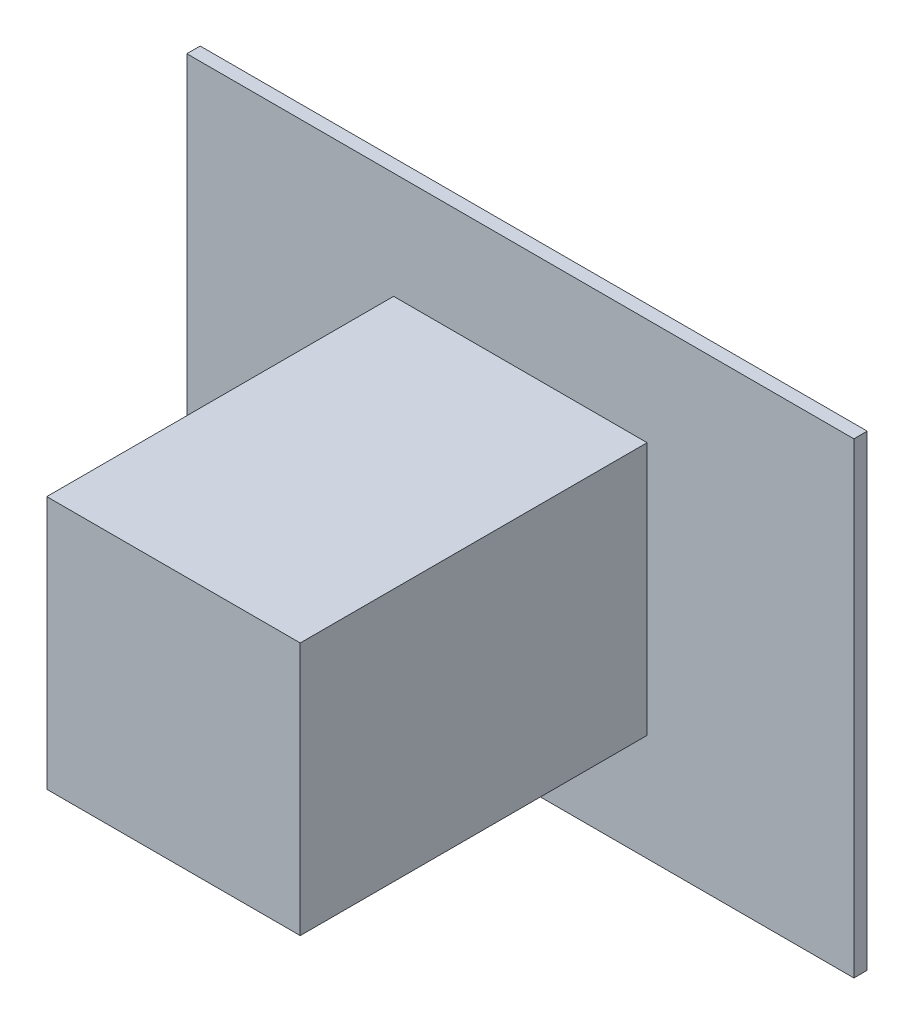
ISO-10303-21;
HEADER;
FILE_DESCRIPTION(('STEP AP214'),'2;1');
FILE_NAME('part.step','',(''),(''),'','','');
FILE_SCHEMA(('AUTOMOTIVE_DESIGN { 1 0 10303 214 1 1 1 1 }'));
ENDSEC;
DATA;
#1=APPLICATION_CONTEXT('core data for automotive mechanical design processes');
#2=APPLICATION_PROTOCOL_DEFINITION('international standard','automotive_design',2000,#1);
#3=PRODUCT_CONTEXT('',#1,'mechanical');
#4=PRODUCT('Part','Part','',(#3));
#5=PRODUCT_RELATED_PRODUCT_CATEGORY('part','',(#4));
#6=PRODUCT_DEFINITION_FORMATION('','',#4);
#7=PRODUCT_DEFINITION_CONTEXT('part definition',#1,'design');
#8=PRODUCT_DEFINITION('design','',#6,#7);
#9=PRODUCT_DEFINITION_SHAPE('','',#8);
#10=(LENGTH_UNIT() NAMED_UNIT(*) SI_UNIT(.MILLI.,.METRE.));
#11=(NAMED_UNIT(*) PLANE_ANGLE_UNIT() SI_UNIT($,.RADIAN.));
#12=(NAMED_UNIT(*) SI_UNIT($,.STERADIAN.) SOLID_ANGLE_UNIT());
#13=UNCERTAINTY_MEASURE_WITH_UNIT(LENGTH_MEASURE(1.E-05),#10,'distance_accuracy_value','');
#14=(GEOMETRIC_REPRESENTATION_CONTEXT(3) GLOBAL_UNCERTAINTY_ASSIGNED_CONTEXT((#13)) GLOBAL_UNIT_ASSIGNED_CONTEXT((#10,
#11,#12)) REPRESENTATION_CONTEXT('',''));
#15=CARTESIAN_POINT('',(0.,0.,0.));
#16=DIRECTION('',(0.,0.,1.));
#17=DIRECTION('',(1.,0.,0.));
#18=AXIS2_PLACEMENT_3D('',#15,#16,#17);
#19=CARTESIAN_POINT('',(-0.949999999999993,-0.950000000000003,3.));
#20=DIRECTION('',(1.,0.,0.));
#21=DIRECTION('',(0.,0.,-0.999999999999999));
#22=AXIS2_PLACEMENT_3D('',#19,#20,#21);
#23=PLANE('',#22);
#24=DIRECTION('',(0.,0.,-0.999999999999999));
#25=VECTOR('',#24,1.);
#26=CARTESIAN_POINT('',(-0.949999999999993,-0.950000000000003,3.));
#27=LINE('',#26,#25);
#28=CARTESIAN_POINT('',(-0.950000000000006,-0.950000000000003,0.300000000000002));
#29=VERTEX_POINT('',#28);
#30=CARTESIAN_POINT('',(-0.950000000000006,-0.950000000000003,0.));
#31=VERTEX_POINT('',#30);
#32=EDGE_CURVE('E249',#29,#31,#27,.T.);
#33=ORIENTED_EDGE('',*,*,#32,.F.);
#34=DIRECTION('',(0.,1.,0.));
#35=VECTOR('',#34,1.);
#36=CARTESIAN_POINT('',(-0.950000000000006,-0.950000000000003,0.300000000000002));
#37=LINE('',#36,#35);
#38=CARTESIAN_POINT('',(-0.949999999999993,0.949999999999996,0.300000000000002));
#39=VERTEX_POINT('',#38);
#40=EDGE_CURVE('E196',#29,#39,#37,.T.);
#41=ORIENTED_EDGE('',*,*,#40,.T.);
#42=DIRECTION('',(0.,0.,-0.999999999999999));
#43=VECTOR('',#42,1.);
#44=CARTESIAN_POINT('',(-0.95,0.949999999999996,3.));
#45=LINE('',#44,#43);
#46=CARTESIAN_POINT('',(-0.949999999999993,0.949999999999996,0.));
#47=VERTEX_POINT('',#46);
#48=EDGE_CURVE('E223',#39,#47,#45,.T.);
#49=ORIENTED_EDGE('',*,*,#48,.T.);
#50=DIRECTION('',(0.,-1.,0.));
#51=VECTOR('',#50,1.);
#52=CARTESIAN_POINT('',(-0.950000000000006,-0.950000000000003,0.));
#53=LINE('',#52,#51);
#54=EDGE_CURVE('E208',#47,#31,#53,.T.);
#55=ORIENTED_EDGE('',*,*,#54,.T.);
#56=EDGE_LOOP('',(#33,#41,#49,#55));
#57=FACE_BOUND('',#56,.T.);
#58=ADVANCED_FACE('F52',(#57),#23,.F.);
#59=CARTESIAN_POINT('',(0.95,-0.949999999999993,3.));
#60=DIRECTION('',(0.,1.,0.));
#61=DIRECTION('',(-1.,0.,0.));
#62=AXIS2_PLACEMENT_3D('',#59,#60,#61);
#63=PLANE('',#62);
#64=DIRECTION('',(0.,0.,-0.999999999999999));
#65=VECTOR('',#64,1.);
#66=CARTESIAN_POINT('',(0.95,-0.949999999999993,3.));
#67=LINE('',#66,#65);
#68=CARTESIAN_POINT('',(0.95,-0.949999999999993,0.300000000000002));
#69=VERTEX_POINT('',#68);
#70=CARTESIAN_POINT('',(0.95,-0.949999999999993,0.));
#71=VERTEX_POINT('',#70);
#72=EDGE_CURVE('E245',#69,#71,#67,.T.);
#73=ORIENTED_EDGE('',*,*,#72,.F.);
#74=DIRECTION('',(-1.,0.,0.));
#75=VECTOR('',#74,1.);
#76=CARTESIAN_POINT('',(0.95,-0.949999999999993,0.300000000000002));
#77=LINE('',#76,#75);
#78=EDGE_CURVE('E192',#69,#29,#77,.T.);
#79=ORIENTED_EDGE('',*,*,#78,.T.);
#80=ORIENTED_EDGE('',*,*,#32,.T.);
#81=DIRECTION('',(1.,0.,0.));
#82=VECTOR('',#81,1.);
#83=CARTESIAN_POINT('',(0.95,-0.949999999999993,0.));
#84=LINE('',#83,#82);
#85=EDGE_CURVE('E227',#31,#71,#84,.T.);
#86=ORIENTED_EDGE('',*,*,#85,.T.);
#87=EDGE_LOOP('',(#73,#79,#80,#86));
#88=FACE_BOUND('',#87,.T.);
#89=ADVANCED_FACE('F272',(#88),#63,.F.);
#90=CARTESIAN_POINT('',(0.95,-0.949999999999993,3.));
#91=DIRECTION('',(-1.,0.,0.));
#92=DIRECTION('',(0.,0.,0.999999999999999));
#93=AXIS2_PLACEMENT_3D('',#90,#91,#92);
#94=PLANE('',#93);
#95=DIRECTION('',(0.,0.,-0.999999999999999));
#96=VECTOR('',#95,1.);
#97=CARTESIAN_POINT('',(0.949999999999993,0.950000000000006,3.));
#98=LINE('',#97,#96);
#99=CARTESIAN_POINT('',(0.95,0.950000000000006,0.300000000000002));
#100=VERTEX_POINT('',#99);
#101=CARTESIAN_POINT('',(0.95,0.950000000000006,0.));
#102=VERTEX_POINT('',#101);
#103=EDGE_CURVE('E241',#100,#102,#98,.T.);
#104=ORIENTED_EDGE('',*,*,#103,.F.);
#105=DIRECTION('',(0.,-1.,0.));
#106=VECTOR('',#105,1.);
#107=CARTESIAN_POINT('',(0.95,-0.949999999999993,0.300000000000002));
#108=LINE('',#107,#106);
#109=EDGE_CURVE('E188',#100,#69,#108,.T.);
#110=ORIENTED_EDGE('',*,*,#109,.T.);
#111=ORIENTED_EDGE('',*,*,#72,.T.);
#112=DIRECTION('',(0.,1.,0.));
#113=VECTOR('',#112,1.);
#114=CARTESIAN_POINT('',(0.95,-0.949999999999993,0.));
#115=LINE('',#114,#113);
#116=EDGE_CURVE('E231',#71,#102,#115,.T.);
#117=ORIENTED_EDGE('',*,*,#116,.T.);
#118=EDGE_LOOP('',(#104,#110,#111,#117));
#119=FACE_BOUND('',#118,.T.);
#120=ADVANCED_FACE('F278',(#119),#94,.F.);
#121=CARTESIAN_POINT('',(0.949999999999993,0.950000000000006,3.));
#122=DIRECTION('',(0.,-1.,0.));
#123=DIRECTION('',(1.,0.,0.));
#124=AXIS2_PLACEMENT_3D('',#121,#122,#123);
#125=PLANE('',#124);
#126=ORIENTED_EDGE('',*,*,#48,.F.);
#127=DIRECTION('',(1.,0.,0.));
#128=VECTOR('',#127,1.);
#129=CARTESIAN_POINT('',(0.95,0.950000000000006,0.300000000000002));
#130=LINE('',#129,#128);
#131=EDGE_CURVE('E13',#39,#100,#130,.T.);
#132=ORIENTED_EDGE('',*,*,#131,.T.);
#133=ORIENTED_EDGE('',*,*,#103,.T.);
#134=DIRECTION('',(-1.,0.,0.));
#135=VECTOR('',#134,1.);
#136=CARTESIAN_POINT('',(0.95,0.950000000000006,0.));
#137=LINE('',#136,#135);
#138=EDGE_CURVE('E214',#102,#47,#137,.T.);
#139=ORIENTED_EDGE('',*,*,#138,.T.);
#140=EDGE_LOOP('',(#126,#132,#133,#139));
#141=FACE_BOUND('',#140,.T.);
#142=ADVANCED_FACE('F319',(#141),#125,.F.);
#143=CARTESIAN_POINT('',(0.,0.,0.));
#144=DIRECTION('',(0.,0.,0.999999999999999));
#145=DIRECTION('',(1.,0.,0.));
#146=AXIS2_PLACEMENT_3D('',#143,#144,#145);
#147=PLANE('',#146);
#148=CARTESIAN_POINT('',(0.,0.,0.));
#149=DIRECTION('',(0.,0.,0.999999999999999));
#150=DIRECTION('',(1.,0.,0.));
#151=AXIS2_PLACEMENT_3D('',#148,#149,#150);
#152=CIRCLE('',#151,0.7);
#153=CARTESIAN_POINT('',(0.7,0.,0.));
#154=VERTEX_POINT('',#153);
#155=EDGE_CURVE('E200',#154,#154,#152,.T.);
#156=ORIENTED_EDGE('',*,*,#155,.T.);
#157=EDGE_LOOP('',(#156));
#158=FACE_BOUND('',#157,.T.);
#159=ORIENTED_EDGE('',*,*,#54,.F.);
#160=ORIENTED_EDGE('',*,*,#138,.F.);
#161=ORIENTED_EDGE('',*,*,#116,.F.);
#162=ORIENTED_EDGE('',*,*,#85,.F.);
#163=EDGE_LOOP('',(#159,#160,#161,#162));
#164=FACE_BOUND('',#163,.T.);
#165=ADVANCED_FACE('F323',(#158,#164),#147,.F.);
#166=CARTESIAN_POINT('',(0.,0.,0.962860279074398));
#167=DIRECTION('',(0.,0.,0.999999999999999));
#168=DIRECTION('',(0.,1.,0.));
#169=AXIS2_PLACEMENT_3D('',#166,#167,#168);
#170=SPHERICAL_SURFACE('',#169,0.700062161687124);
#171=CARTESIAN_POINT('',(0.,0.,0.972189278273056));
#172=DIRECTION('',(0.,0.,0.999999999999999));
#173=DIRECTION('',(1.,0.,0.));
#174=AXIS2_PLACEMENT_3D('',#171,#172,#173);
#175=CIRCLE('',#174,0.7);
#176=CARTESIAN_POINT('',(0.7,0.,0.972189278273056));
#177=VERTEX_POINT('',#176);
#178=EDGE_CURVE('E204',#177,#177,#175,.T.);
#179=ORIENTED_EDGE('',*,*,#178,.F.);
#180=EDGE_LOOP('',(#179));
#181=FACE_BOUND('',#180,.T.);
#182=ADVANCED_FACE('F335',(#181),#170,.F.);
#183=CARTESIAN_POINT('',(0.,0.,5.25));
#184=DIRECTION('',(0.,0.,0.999999999999999));
#185=DIRECTION('',(1.,0.,0.));
#186=AXIS2_PLACEMENT_3D('',#183,#184,#185);
#187=CYLINDRICAL_SURFACE('',#186,0.7);
#188=ORIENTED_EDGE('',*,*,#178,.T.);
#189=EDGE_LOOP('',(#188));
#190=FACE_BOUND('',#189,.T.);
#191=ORIENTED_EDGE('',*,*,#155,.F.);
#192=EDGE_LOOP('',(#191));
#193=FACE_BOUND('',#192,.T.);
#194=ADVANCED_FACE('F327',(#190,#193),#187,.F.);
#195=CARTESIAN_POINT('',(0.,0.,0.300000000000002));
#196=DIRECTION('',(0.,0.,-0.999999999999999));
#197=DIRECTION('',(-1.,0.,0.));
#198=AXIS2_PLACEMENT_3D('',#195,#196,#197);
#199=PLANE('',#198);
#200=DIRECTION('',(0.,1.,0.));
#201=VECTOR('',#200,1.);
#202=CARTESIAN_POINT('',(-2.5,1.75,0.300000000000002));
#203=LINE('',#202,#201);
#204=CARTESIAN_POINT('',(-2.50000000000001,-1.75,0.300000000000002));
#205=VERTEX_POINT('',#204);
#206=CARTESIAN_POINT('',(-2.5,1.75,0.300000000000002));
#207=VERTEX_POINT('',#206);
#208=EDGE_CURVE('E156',#205,#207,#203,.T.);
#209=ORIENTED_EDGE('',*,*,#208,.T.);
#210=DIRECTION('',(1.,0.,0.));
#211=VECTOR('',#210,1.);
#212=CARTESIAN_POINT('',(2.5,1.75000000000001,0.300000000000009));
#213=LINE('',#212,#211);
#214=CARTESIAN_POINT('',(2.5,1.75000000000001,0.300000000000009));
#215=VERTEX_POINT('',#214);
#216=EDGE_CURVE('E144',#207,#215,#213,.T.);
#217=ORIENTED_EDGE('',*,*,#216,.T.);
#218=DIRECTION('',(0.,-1.,0.));
#219=VECTOR('',#218,1.);
#220=CARTESIAN_POINT('',(2.5,1.75000000000001,0.300000000000009));
#221=LINE('',#220,#219);
#222=CARTESIAN_POINT('',(2.5,-1.74999999999999,0.300000000000009));
#223=VERTEX_POINT('',#222);
#224=EDGE_CURVE('E155',#215,#223,#221,.T.);
#225=ORIENTED_EDGE('',*,*,#224,.T.);
#226=DIRECTION('',(-1.,0.,0.));
#227=VECTOR('',#226,1.);
#228=CARTESIAN_POINT('',(2.5,-1.74999999999999,0.300000000000009));
#229=LINE('',#228,#227);
#230=EDGE_CURVE('E162',#223,#205,#229,.T.);
#231=ORIENTED_EDGE('',*,*,#230,.T.);
#232=EDGE_LOOP('',(#209,#217,#225,#231));
#233=FACE_BOUND('',#232,.T.);
#234=ORIENTED_EDGE('',*,*,#40,.F.);
#235=ORIENTED_EDGE('',*,*,#78,.F.);
#236=ORIENTED_EDGE('',*,*,#109,.F.);
#237=ORIENTED_EDGE('',*,*,#131,.F.);
#238=EDGE_LOOP('',(#234,#235,#236,#237));
#239=FACE_BOUND('',#238,.T.);
#240=ADVANCED_FACE('F159',(#233,#239),#199,.T.);
#241=CARTESIAN_POINT('',(0.,0.,0.399999999999998));
#242=DIRECTION('',(0.,0.,-0.999999999999999));
#243=DIRECTION('',(-1.,0.,0.));
#244=AXIS2_PLACEMENT_3D('',#241,#242,#243);
#245=PLANE('',#244);
#246=DIRECTION('',(0.,1.,0.));
#247=VECTOR('',#246,1.);
#248=CARTESIAN_POINT('',(-2.5,1.75,0.400000000000005));
#249=LINE('',#248,#247);
#250=CARTESIAN_POINT('',(-2.50000000000001,-1.75,0.400000000000005));
#251=VERTEX_POINT('',#250);
#252=CARTESIAN_POINT('',(-2.5,1.75,0.400000000000005));
#253=VERTEX_POINT('',#252);
#254=EDGE_CURVE('E171',#251,#253,#249,.T.);
#255=ORIENTED_EDGE('',*,*,#254,.F.);
#256=DIRECTION('',(-1.,0.,0.));
#257=VECTOR('',#256,1.);
#258=CARTESIAN_POINT('',(2.5,-1.74999999999999,0.400000000000011));
#259=LINE('',#258,#257);
#260=CARTESIAN_POINT('',(2.5,-1.74999999999999,0.400000000000011));
#261=VERTEX_POINT('',#260);
#262=EDGE_CURVE('E167',#261,#251,#259,.T.);
#263=ORIENTED_EDGE('',*,*,#262,.F.);
#264=DIRECTION('',(0.,-1.,0.));
#265=VECTOR('',#264,1.);
#266=CARTESIAN_POINT('',(2.5,1.75000000000001,0.400000000000011));
#267=LINE('',#266,#265);
#268=CARTESIAN_POINT('',(2.5,1.75000000000001,0.400000000000011));
#269=VERTEX_POINT('',#268);
#270=EDGE_CURVE('E469',#269,#261,#267,.T.);
#271=ORIENTED_EDGE('',*,*,#270,.F.);
#272=DIRECTION('',(1.,0.,0.));
#273=VECTOR('',#272,1.);
#274=CARTESIAN_POINT('',(2.5,1.75000000000001,0.400000000000011));
#275=LINE('',#274,#273);
#276=EDGE_CURVE('E473',#253,#269,#275,.T.);
#277=ORIENTED_EDGE('',*,*,#276,.F.);
#278=EDGE_LOOP('',(#255,#263,#271,#277));
#279=FACE_BOUND('',#278,.T.);
#280=DIRECTION('',(-1.,0.,0.));
#281=VECTOR('',#280,1.);
#282=CARTESIAN_POINT('',(0.95,-0.949999999999993,0.399999999999998));
#283=LINE('',#282,#281);
#284=CARTESIAN_POINT('',(0.95,-0.949999999999993,0.399999999999998));
#285=VERTEX_POINT('',#284);
#286=CARTESIAN_POINT('',(-0.950000000000006,-0.950000000000003,0.400000000000005));
#287=VERTEX_POINT('',#286);
#288=EDGE_CURVE('E74',#285,#287,#283,.T.);
#289=ORIENTED_EDGE('',*,*,#288,.T.);
#290=DIRECTION('',(0.,1.,0.));
#291=VECTOR('',#290,1.);
#292=CARTESIAN_POINT('',(-0.950000000000006,-0.950000000000003,0.400000000000005));
#293=LINE('',#292,#291);
#294=CARTESIAN_POINT('',(-0.949999999999993,0.949999999999996,0.400000000000005));
#295=VERTEX_POINT('',#294);
#296=EDGE_CURVE('E67',#287,#295,#293,.T.);
#297=ORIENTED_EDGE('',*,*,#296,.T.);
#298=DIRECTION('',(1.,0.,0.));
#299=VECTOR('',#298,1.);
#300=CARTESIAN_POINT('',(0.95,0.950000000000006,0.399999999999998));
#301=LINE('',#300,#299);
#302=CARTESIAN_POINT('',(0.95,0.950000000000006,0.399999999999998));
#303=VERTEX_POINT('',#302);
#304=EDGE_CURVE('E60',#295,#303,#301,.T.);
#305=ORIENTED_EDGE('',*,*,#304,.T.);
#306=DIRECTION('',(0.,-1.,0.));
#307=VECTOR('',#306,1.);
#308=CARTESIAN_POINT('',(0.95,-0.949999999999993,0.399999999999998));
#309=LINE('',#308,#307);
#310=EDGE_CURVE('E173',#303,#285,#309,.T.);
#311=ORIENTED_EDGE('',*,*,#310,.T.);
#312=EDGE_LOOP('',(#289,#297,#305,#311));
#313=FACE_BOUND('',#312,.T.);
#314=ADVANCED_FACE('F256',(#279,#313),#245,.F.);
#315=CARTESIAN_POINT('',(-2.5,1.75,0.300000000000002));
#316=DIRECTION('',(1.,0.,0.));
#317=DIRECTION('',(0.,1.,0.));
#318=AXIS2_PLACEMENT_3D('',#315,#316,#317);
#319=PLANE('',#318);
#320=ORIENTED_EDGE('',*,*,#254,.T.);
#321=DIRECTION('',(0.,0.,0.999999999999999));
#322=VECTOR('',#321,1.);
#323=CARTESIAN_POINT('',(-2.5,1.75,0.300000000000002));
#324=LINE('',#323,#322);
#325=EDGE_CURVE('E148',#207,#253,#324,.T.);
#326=ORIENTED_EDGE('',*,*,#325,.F.);
#327=ORIENTED_EDGE('',*,*,#208,.F.);
#328=DIRECTION('',(0.,0.,0.999999999999999));
#329=VECTOR('',#328,1.);
#330=CARTESIAN_POINT('',(-2.50000000000001,-1.75,0.300000000000002));
#331=LINE('',#330,#329);
#332=EDGE_CURVE('E476',#205,#251,#331,.T.);
#333=ORIENTED_EDGE('',*,*,#332,.T.);
#334=EDGE_LOOP('',(#320,#326,#327,#333));
#335=FACE_BOUND('',#334,.T.);
#336=ADVANCED_FACE('F169',(#335),#319,.F.);
#337=CARTESIAN_POINT('',(2.5,1.75000000000001,0.300000000000009));
#338=DIRECTION('',(0.,-1.,0.));
#339=DIRECTION('',(0.,0.,-0.999999999999999));
#340=AXIS2_PLACEMENT_3D('',#337,#338,#339);
#341=PLANE('',#340);
#342=ORIENTED_EDGE('',*,*,#276,.T.);
#343=DIRECTION('',(0.,0.,0.999999999999999));
#344=VECTOR('',#343,1.);
#345=CARTESIAN_POINT('',(2.5,1.75000000000001,0.300000000000009));
#346=LINE('',#345,#344);
#347=EDGE_CURVE('E151',#215,#269,#346,.T.);
#348=ORIENTED_EDGE('',*,*,#347,.F.);
#349=ORIENTED_EDGE('',*,*,#216,.F.);
#350=ORIENTED_EDGE('',*,*,#325,.T.);
#351=EDGE_LOOP('',(#342,#348,#349,#350));
#352=FACE_BOUND('',#351,.T.);
#353=ADVANCED_FACE('F146',(#352),#341,.F.);
#354=CARTESIAN_POINT('',(2.5,1.75000000000001,0.300000000000009));
#355=DIRECTION('',(-1.,0.,0.));
#356=DIRECTION('',(0.,-1.,0.));
#357=AXIS2_PLACEMENT_3D('',#354,#355,#356);
#358=PLANE('',#357);
#359=ORIENTED_EDGE('',*,*,#270,.T.);
#360=DIRECTION('',(0.,0.,0.999999999999999));
#361=VECTOR('',#360,1.);
#362=CARTESIAN_POINT('',(2.5,-1.74999999999999,0.300000000000009));
#363=LINE('',#362,#361);
#364=EDGE_CURVE('E180',#223,#261,#363,.T.);
#365=ORIENTED_EDGE('',*,*,#364,.F.);
#366=ORIENTED_EDGE('',*,*,#224,.F.);
#367=ORIENTED_EDGE('',*,*,#347,.T.);
#368=EDGE_LOOP('',(#359,#365,#366,#367));
#369=FACE_BOUND('',#368,.T.);
#370=ADVANCED_FACE('F342',(#369),#358,.F.);
#371=CARTESIAN_POINT('',(2.5,-1.74999999999999,0.300000000000009));
#372=DIRECTION('',(0.,1.,0.));
#373=DIRECTION('',(0.,0.,0.999999999999999));
#374=AXIS2_PLACEMENT_3D('',#371,#372,#373);
#375=PLANE('',#374);
#376=ORIENTED_EDGE('',*,*,#262,.T.);
#377=ORIENTED_EDGE('',*,*,#332,.F.);
#378=ORIENTED_EDGE('',*,*,#230,.F.);
#379=ORIENTED_EDGE('',*,*,#364,.T.);
#380=EDGE_LOOP('',(#376,#377,#378,#379));
#381=FACE_BOUND('',#380,.T.);
#382=ADVANCED_FACE('F339',(#381),#375,.F.);
#383=CARTESIAN_POINT('',(0.,0.,3.));
#384=DIRECTION('',(0.,0.,0.999999999999999));
#385=DIRECTION('',(1.,0.,0.));
#386=AXIS2_PLACEMENT_3D('',#383,#384,#385);
#387=PLANE('',#386);
#388=DIRECTION('',(0.,-1.,0.));
#389=VECTOR('',#388,1.);
#390=CARTESIAN_POINT('',(-0.949999999999993,-0.950000000000003,3.));
#391=LINE('',#390,#389);
#392=CARTESIAN_POINT('',(-0.95,0.949999999999996,3.));
#393=VERTEX_POINT('',#392);
#394=CARTESIAN_POINT('',(-0.949999999999993,-0.950000000000003,3.));
#395=VERTEX_POINT('',#394);
#396=EDGE_CURVE('E209',#393,#395,#391,.T.);
#397=ORIENTED_EDGE('',*,*,#396,.T.);
#398=DIRECTION('',(1.,0.,0.));
#399=VECTOR('',#398,1.);
#400=CARTESIAN_POINT('',(0.95,-0.949999999999993,3.));
#401=LINE('',#400,#399);
#402=CARTESIAN_POINT('',(0.95,-0.949999999999993,3.));
#403=VERTEX_POINT('',#402);
#404=EDGE_CURVE('E213',#395,#403,#401,.T.);
#405=ORIENTED_EDGE('',*,*,#404,.T.);
#406=DIRECTION('',(0.,1.,0.));
#407=VECTOR('',#406,1.);
#408=CARTESIAN_POINT('',(0.95,-0.949999999999993,3.));
#409=LINE('',#408,#407);
#410=CARTESIAN_POINT('',(0.949999999999993,0.950000000000006,3.));
#411=VERTEX_POINT('',#410);
#412=EDGE_CURVE('E217',#403,#411,#409,.T.);
#413=ORIENTED_EDGE('',*,*,#412,.T.);
#414=DIRECTION('',(-1.,0.,0.));
#415=VECTOR('',#414,1.);
#416=CARTESIAN_POINT('',(0.949999999999993,0.950000000000006,3.));
#417=LINE('',#416,#415);
#418=EDGE_CURVE('E220',#411,#393,#417,.T.);
#419=ORIENTED_EDGE('',*,*,#418,.T.);
#420=EDGE_LOOP('',(#397,#405,#413,#419));
#421=FACE_BOUND('',#420,.T.);
#422=ADVANCED_FACE('F266',(#421),#387,.T.);
#423=ORIENTED_EDGE('',*,*,#304,.F.);
#424=EDGE_CURVE('E238',#393,#295,#45,.T.);
#425=ORIENTED_EDGE('',*,*,#424,.F.);
#426=ORIENTED_EDGE('',*,*,#418,.F.);
#427=EDGE_CURVE('E242',#411,#303,#98,.T.);
#428=ORIENTED_EDGE('',*,*,#427,.T.);
#429=EDGE_LOOP('',(#423,#425,#426,#428));
#430=FACE_BOUND('',#429,.T.);
#431=ADVANCED_FACE('F260',(#430),#125,.F.);
#432=ORIENTED_EDGE('',*,*,#310,.F.);
#433=ORIENTED_EDGE('',*,*,#427,.F.);
#434=ORIENTED_EDGE('',*,*,#412,.F.);
#435=EDGE_CURVE('E246',#403,#285,#67,.T.);
#436=ORIENTED_EDGE('',*,*,#435,.T.);
#437=EDGE_LOOP('',(#432,#433,#434,#436));
#438=FACE_BOUND('',#437,.T.);
#439=ADVANCED_FACE('F269',(#438),#94,.F.);
#440=ORIENTED_EDGE('',*,*,#288,.F.);
#441=ORIENTED_EDGE('',*,*,#435,.F.);
#442=ORIENTED_EDGE('',*,*,#404,.F.);
#443=EDGE_CURVE('E250',#395,#287,#27,.T.);
#444=ORIENTED_EDGE('',*,*,#443,.T.);
#445=EDGE_LOOP('',(#440,#441,#442,#444));
#446=FACE_BOUND('',#445,.T.);
#447=ADVANCED_FACE('F270',(#446),#63,.F.);
#448=ORIENTED_EDGE('',*,*,#296,.F.);
#449=ORIENTED_EDGE('',*,*,#443,.F.);
#450=ORIENTED_EDGE('',*,*,#396,.F.);
#451=ORIENTED_EDGE('',*,*,#424,.T.);
#452=EDGE_LOOP('',(#448,#449,#450,#451));
#453=FACE_BOUND('',#452,.T.);
#454=ADVANCED_FACE('F264',(#453),#23,.F.);
#455=CLOSED_SHELL('',(#58,#89,#120,#142,#165,#182,#194,#240,#314,#336,#353,#370,#382,#422,#431,
#439,#447,#454));
#456=MANIFOLD_SOLID_BREP('B2',#455);
#457=ADVANCED_BREP_SHAPE_REPRESENTATION('',(#18,#456),#14);
#458=SHAPE_DEFINITION_REPRESENTATION(#9,#457);
ENDSEC;
END-ISO-10303-21;
